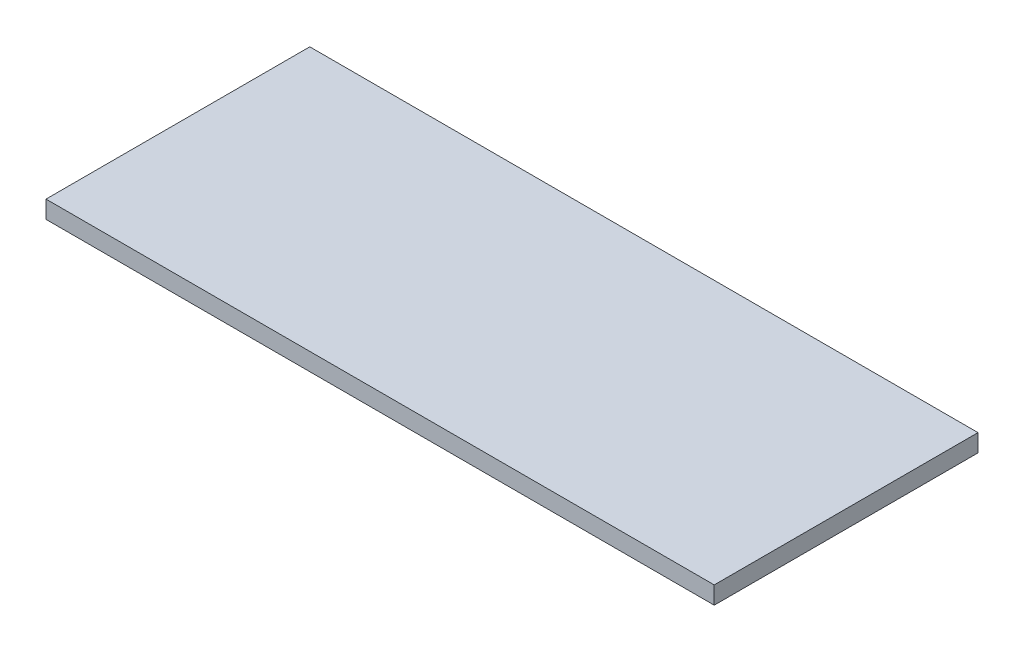
ISO-10303-21;
HEADER;
FILE_DESCRIPTION(('STEP AP214'),'2;1');
FILE_NAME('part.step','',(''),(''),'','','');
FILE_SCHEMA(('AUTOMOTIVE_DESIGN { 1 0 10303 214 1 1 1 1 }'));
ENDSEC;
DATA;
#1=APPLICATION_CONTEXT('core data for automotive mechanical design processes');
#2=APPLICATION_PROTOCOL_DEFINITION('international standard','automotive_design',2000,#1);
#3=PRODUCT_CONTEXT('',#1,'mechanical');
#4=PRODUCT('Part','Part','',(#3));
#5=PRODUCT_RELATED_PRODUCT_CATEGORY('part','',(#4));
#6=PRODUCT_DEFINITION_FORMATION('','',#4);
#7=PRODUCT_DEFINITION_CONTEXT('part definition',#1,'design');
#8=PRODUCT_DEFINITION('design','',#6,#7);
#9=PRODUCT_DEFINITION_SHAPE('','',#8);
#10=(LENGTH_UNIT() NAMED_UNIT(*) SI_UNIT(.MILLI.,.METRE.));
#11=(NAMED_UNIT(*) PLANE_ANGLE_UNIT() SI_UNIT($,.RADIAN.));
#12=(NAMED_UNIT(*) SI_UNIT($,.STERADIAN.) SOLID_ANGLE_UNIT());
#13=UNCERTAINTY_MEASURE_WITH_UNIT(LENGTH_MEASURE(1.E-05),#10,'distance_accuracy_value','');
#14=(GEOMETRIC_REPRESENTATION_CONTEXT(3) GLOBAL_UNCERTAINTY_ASSIGNED_CONTEXT((#13)) GLOBAL_UNIT_ASSIGNED_CONTEXT((#10,
#11,#12)) REPRESENTATION_CONTEXT('',''));
#15=CARTESIAN_POINT('',(0.,0.,0.));
#16=DIRECTION('',(0.,0.,1.));
#17=DIRECTION('',(1.,0.,0.));
#18=AXIS2_PLACEMENT_3D('',#15,#16,#17);
#19=CARTESIAN_POINT('',(0.,8.,0.));
#20=DIRECTION('',(1.,0.,0.));
#21=DIRECTION('',(0.,0.,-1.));
#22=AXIS2_PLACEMENT_3D('',#19,#20,#21);
#23=PLANE('',#22);
#24=DIRECTION('',(0.,0.,1.));
#25=VECTOR('',#24,1.);
#26=CARTESIAN_POINT('',(0.,0.,0.));
#27=LINE('',#26,#25);
#28=CARTESIAN_POINT('',(0.,0.,-120.));
#29=VERTEX_POINT('',#28);
#30=CARTESIAN_POINT('',(0.,0.,0.));
#31=VERTEX_POINT('',#30);
#32=EDGE_CURVE('E96',#29,#31,#27,.T.);
#33=ORIENTED_EDGE('',*,*,#32,.T.);
#34=DIRECTION('',(0.,-1.,0.));
#35=VECTOR('',#34,1.);
#36=CARTESIAN_POINT('',(0.,8.,0.));
#37=LINE('',#36,#35);
#38=CARTESIAN_POINT('',(0.,8.,0.));
#39=VERTEX_POINT('',#38);
#40=EDGE_CURVE('E11',#39,#31,#37,.T.);
#41=ORIENTED_EDGE('',*,*,#40,.F.);
#42=DIRECTION('',(0.,0.,1.));
#43=VECTOR('',#42,1.);
#44=CARTESIAN_POINT('',(0.,8.,0.));
#45=LINE('',#44,#43);
#46=CARTESIAN_POINT('',(0.,8.,-120.));
#47=VERTEX_POINT('',#46);
#48=EDGE_CURVE('E84',#47,#39,#45,.T.);
#49=ORIENTED_EDGE('',*,*,#48,.F.);
#50=DIRECTION('',(0.,-1.,0.));
#51=VECTOR('',#50,1.);
#52=CARTESIAN_POINT('',(0.,8.,-120.));
#53=LINE('',#52,#51);
#54=EDGE_CURVE('E92',#47,#29,#53,.T.);
#55=ORIENTED_EDGE('',*,*,#54,.T.);
#56=EDGE_LOOP('',(#33,#41,#49,#55));
#57=FACE_BOUND('',#56,.T.);
#58=ADVANCED_FACE('F33',(#57),#23,.F.);
#59=CARTESIAN_POINT('',(0.,8.,0.));
#60=DIRECTION('',(0.,0.,-1.));
#61=DIRECTION('',(-1.,0.,0.));
#62=AXIS2_PLACEMENT_3D('',#59,#60,#61);
#63=PLANE('',#62);
#64=DIRECTION('',(1.,0.,0.));
#65=VECTOR('',#64,1.);
#66=CARTESIAN_POINT('',(0.,0.,0.));
#67=LINE('',#66,#65);
#68=CARTESIAN_POINT('',(304.,0.,0.));
#69=VERTEX_POINT('',#68);
#70=EDGE_CURVE('E88',#31,#69,#67,.T.);
#71=ORIENTED_EDGE('',*,*,#70,.T.);
#72=DIRECTION('',(0.,-1.,0.));
#73=VECTOR('',#72,1.);
#74=CARTESIAN_POINT('',(304.,8.,0.));
#75=LINE('',#74,#73);
#76=CARTESIAN_POINT('',(304.,8.,0.));
#77=VERTEX_POINT('',#76);
#78=EDGE_CURVE('E41',#77,#69,#75,.T.);
#79=ORIENTED_EDGE('',*,*,#78,.F.);
#80=DIRECTION('',(1.,0.,0.));
#81=VECTOR('',#80,1.);
#82=CARTESIAN_POINT('',(0.,8.,0.));
#83=LINE('',#82,#81);
#84=EDGE_CURVE('E79',#39,#77,#83,.T.);
#85=ORIENTED_EDGE('',*,*,#84,.F.);
#86=ORIENTED_EDGE('',*,*,#40,.T.);
#87=EDGE_LOOP('',(#71,#79,#85,#86));
#88=FACE_BOUND('',#87,.T.);
#89=ADVANCED_FACE('F87',(#88),#63,.F.);
#90=CARTESIAN_POINT('',(304.,8.,0.));
#91=DIRECTION('',(-1.,0.,0.));
#92=DIRECTION('',(0.,0.,1.));
#93=AXIS2_PLACEMENT_3D('',#90,#91,#92);
#94=PLANE('',#93);
#95=DIRECTION('',(0.,0.,-1.));
#96=VECTOR('',#95,1.);
#97=CARTESIAN_POINT('',(304.,0.,0.));
#98=LINE('',#97,#96);
#99=CARTESIAN_POINT('',(304.,0.,-120.));
#100=VERTEX_POINT('',#99);
#101=EDGE_CURVE('E66',#69,#100,#98,.T.);
#102=ORIENTED_EDGE('',*,*,#101,.T.);
#103=DIRECTION('',(0.,-1.,0.));
#104=VECTOR('',#103,1.);
#105=CARTESIAN_POINT('',(304.,8.,-120.));
#106=LINE('',#105,#104);
#107=CARTESIAN_POINT('',(304.,8.,-120.));
#108=VERTEX_POINT('',#107);
#109=EDGE_CURVE('E89',#108,#100,#106,.T.);
#110=ORIENTED_EDGE('',*,*,#109,.F.);
#111=DIRECTION('',(0.,0.,-1.));
#112=VECTOR('',#111,1.);
#113=CARTESIAN_POINT('',(304.,8.,0.));
#114=LINE('',#113,#112);
#115=EDGE_CURVE('E82',#77,#108,#114,.T.);
#116=ORIENTED_EDGE('',*,*,#115,.F.);
#117=ORIENTED_EDGE('',*,*,#78,.T.);
#118=EDGE_LOOP('',(#102,#110,#116,#117));
#119=FACE_BOUND('',#118,.T.);
#120=ADVANCED_FACE('F90',(#119),#94,.F.);
#121=CARTESIAN_POINT('',(0.,8.,-120.));
#122=DIRECTION('',(0.,0.,1.));
#123=DIRECTION('',(1.,0.,0.));
#124=AXIS2_PLACEMENT_3D('',#121,#122,#123);
#125=PLANE('',#124);
#126=DIRECTION('',(-1.,0.,0.));
#127=VECTOR('',#126,1.);
#128=CARTESIAN_POINT('',(0.,0.,-120.));
#129=LINE('',#128,#127);
#130=EDGE_CURVE('E72',#100,#29,#129,.T.);
#131=ORIENTED_EDGE('',*,*,#130,.T.);
#132=ORIENTED_EDGE('',*,*,#54,.F.);
#133=DIRECTION('',(-1.,0.,0.));
#134=VECTOR('',#133,1.);
#135=CARTESIAN_POINT('',(0.,8.,-120.));
#136=LINE('',#135,#134);
#137=EDGE_CURVE('E49',#108,#47,#136,.T.);
#138=ORIENTED_EDGE('',*,*,#137,.F.);
#139=ORIENTED_EDGE('',*,*,#109,.T.);
#140=EDGE_LOOP('',(#131,#132,#138,#139));
#141=FACE_BOUND('',#140,.T.);
#142=ADVANCED_FACE('F103',(#141),#125,.F.);
#143=CARTESIAN_POINT('',(0.,8.,0.));
#144=DIRECTION('',(0.,-1.,0.));
#145=DIRECTION('',(0.,0.,-1.));
#146=AXIS2_PLACEMENT_3D('',#143,#144,#145);
#147=PLANE('',#146);
#148=ORIENTED_EDGE('',*,*,#48,.T.);
#149=ORIENTED_EDGE('',*,*,#84,.T.);
#150=ORIENTED_EDGE('',*,*,#115,.T.);
#151=ORIENTED_EDGE('',*,*,#137,.T.);
#152=EDGE_LOOP('',(#148,#149,#150,#151));
#153=FACE_BOUND('',#152,.T.);
#154=ADVANCED_FACE('F80',(#153),#147,.F.);
#155=CARTESIAN_POINT('',(0.,0.,0.));
#156=DIRECTION('',(0.,-1.,0.));
#157=DIRECTION('',(0.,0.,-1.));
#158=AXIS2_PLACEMENT_3D('',#155,#156,#157);
#159=PLANE('',#158);
#160=ORIENTED_EDGE('',*,*,#32,.F.);
#161=ORIENTED_EDGE('',*,*,#130,.F.);
#162=ORIENTED_EDGE('',*,*,#101,.F.);
#163=ORIENTED_EDGE('',*,*,#70,.F.);
#164=EDGE_LOOP('',(#160,#161,#162,#163));
#165=FACE_BOUND('',#164,.T.);
#166=ADVANCED_FACE('F106',(#165),#159,.T.);
#167=CLOSED_SHELL('',(#58,#89,#120,#142,#154,#166));
#168=MANIFOLD_SOLID_BREP('B2',#167);
#169=ADVANCED_BREP_SHAPE_REPRESENTATION('',(#18,#168),#14);
#170=SHAPE_DEFINITION_REPRESENTATION(#9,#169);
ENDSEC;
END-ISO-10303-21;
